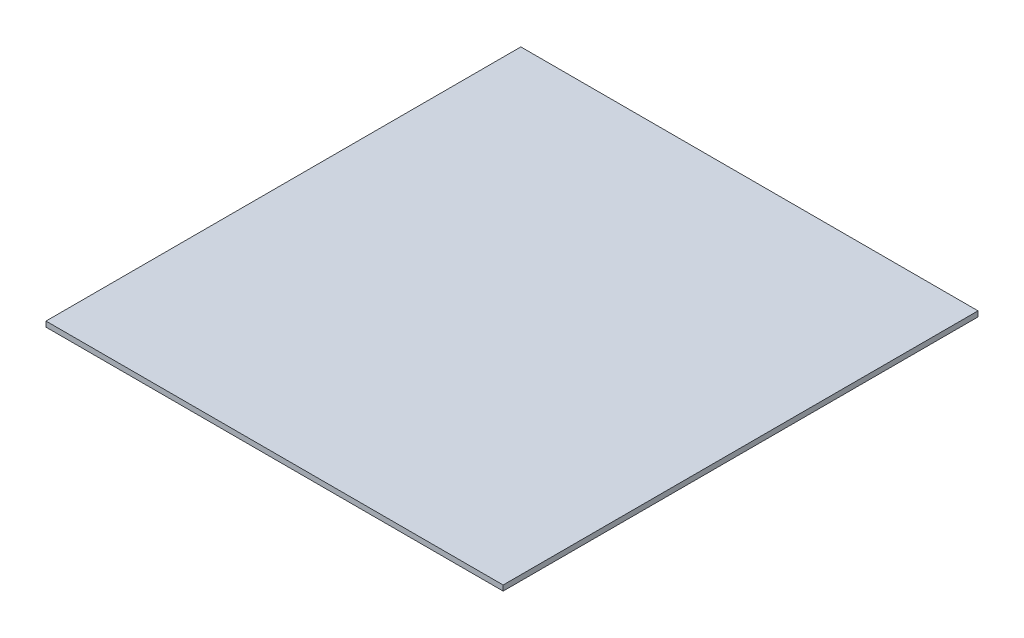
ISO-10303-21;
HEADER;
FILE_DESCRIPTION(('STEP AP214'),'2;1');
FILE_NAME('part.step','',(''),(''),'','','');
FILE_SCHEMA(('AUTOMOTIVE_DESIGN { 1 0 10303 214 1 1 1 1 }'));
ENDSEC;
DATA;
#1=APPLICATION_CONTEXT('core data for automotive mechanical design processes');
#2=APPLICATION_PROTOCOL_DEFINITION('international standard','automotive_design',2000,#1);
#3=PRODUCT_CONTEXT('',#1,'mechanical');
#4=PRODUCT('Part','Part','',(#3));
#5=PRODUCT_RELATED_PRODUCT_CATEGORY('part','',(#4));
#6=PRODUCT_DEFINITION_FORMATION('','',#4);
#7=PRODUCT_DEFINITION_CONTEXT('part definition',#1,'design');
#8=PRODUCT_DEFINITION('design','',#6,#7);
#9=PRODUCT_DEFINITION_SHAPE('','',#8);
#10=(LENGTH_UNIT() NAMED_UNIT(*) SI_UNIT(.MILLI.,.METRE.));
#11=(NAMED_UNIT(*) PLANE_ANGLE_UNIT() SI_UNIT($,.RADIAN.));
#12=(NAMED_UNIT(*) SI_UNIT($,.STERADIAN.) SOLID_ANGLE_UNIT());
#13=UNCERTAINTY_MEASURE_WITH_UNIT(LENGTH_MEASURE(1.E-05),#10,'distance_accuracy_value','');
#14=(GEOMETRIC_REPRESENTATION_CONTEXT(3) GLOBAL_UNCERTAINTY_ASSIGNED_CONTEXT((#13)) GLOBAL_UNIT_ASSIGNED_CONTEXT((#10,
#11,#12)) REPRESENTATION_CONTEXT('',''));
#15=CARTESIAN_POINT('',(0.,0.,0.));
#16=DIRECTION('',(0.,0.,1.));
#17=DIRECTION('',(1.,0.,0.));
#18=AXIS2_PLACEMENT_3D('',#15,#16,#17);
#19=CARTESIAN_POINT('',(0.,29.4,-130.));
#20=DIRECTION('',(-1.,0.,0.));
#21=DIRECTION('',(0.,0.,1.));
#22=AXIS2_PLACEMENT_3D('',#19,#20,#21);
#23=PLANE('',#22);
#24=DIRECTION('',(0.,0.,1.));
#25=VECTOR('',#24,1.);
#26=CARTESIAN_POINT('',(0.,30.,-130.));
#27=LINE('',#26,#25);
#28=CARTESIAN_POINT('',(0.,30.,-130.));
#29=VERTEX_POINT('',#28);
#30=CARTESIAN_POINT('',(0.,30.,0.));
#31=VERTEX_POINT('',#30);
#32=EDGE_CURVE('E131',#29,#31,#27,.T.);
#33=ORIENTED_EDGE('',*,*,#32,.F.);
#34=DIRECTION('',(0.,1.,0.));
#35=VECTOR('',#34,1.);
#36=CARTESIAN_POINT('',(0.,29.4,-130.));
#37=LINE('',#36,#35);
#38=CARTESIAN_POINT('',(0.,29.4,-130.));
#39=VERTEX_POINT('',#38);
#40=EDGE_CURVE('E11',#39,#29,#37,.T.);
#41=ORIENTED_EDGE('',*,*,#40,.F.);
#42=DIRECTION('',(0.,0.,1.));
#43=VECTOR('',#42,1.);
#44=CARTESIAN_POINT('',(0.,29.4,-130.));
#45=LINE('',#44,#43);
#46=CARTESIAN_POINT('',(0.,29.4,0.));
#47=VERTEX_POINT('',#46);
#48=EDGE_CURVE('E140',#39,#47,#45,.T.);
#49=ORIENTED_EDGE('',*,*,#48,.T.);
#50=DIRECTION('',(0.,1.,0.));
#51=VECTOR('',#50,1.);
#52=CARTESIAN_POINT('',(0.,29.4,0.));
#53=LINE('',#52,#51);
#54=EDGE_CURVE('E39',#47,#31,#53,.T.);
#55=ORIENTED_EDGE('',*,*,#54,.T.);
#56=EDGE_LOOP('',(#33,#41,#49,#55));
#57=FACE_BOUND('',#56,.T.);
#58=ADVANCED_FACE('F36',(#57),#23,.T.);
#59=CARTESIAN_POINT('',(0.,29.4,-130.));
#60=DIRECTION('',(0.,0.,-1.));
#61=DIRECTION('',(-1.,0.,0.));
#62=AXIS2_PLACEMENT_3D('',#59,#60,#61);
#63=PLANE('',#62);
#64=DIRECTION('',(-1.,0.,0.));
#65=VECTOR('',#64,1.);
#66=CARTESIAN_POINT('',(0.,30.,-130.));
#67=LINE('',#66,#65);
#68=CARTESIAN_POINT('',(125.,30.,-130.));
#69=VERTEX_POINT('',#68);
#70=EDGE_CURVE('E143',#69,#29,#67,.T.);
#71=ORIENTED_EDGE('',*,*,#70,.F.);
#72=DIRECTION('',(0.,1.,0.));
#73=VECTOR('',#72,1.);
#74=CARTESIAN_POINT('',(125.,29.4,-130.));
#75=LINE('',#74,#73);
#76=CARTESIAN_POINT('',(125.,29.4,-130.));
#77=VERTEX_POINT('',#76);
#78=EDGE_CURVE('E45',#77,#69,#75,.T.);
#79=ORIENTED_EDGE('',*,*,#78,.F.);
#80=DIRECTION('',(-1.,0.,0.));
#81=VECTOR('',#80,1.);
#82=CARTESIAN_POINT('',(0.,29.4,-130.));
#83=LINE('',#82,#81);
#84=EDGE_CURVE('E147',#77,#39,#83,.T.);
#85=ORIENTED_EDGE('',*,*,#84,.T.);
#86=ORIENTED_EDGE('',*,*,#40,.T.);
#87=EDGE_LOOP('',(#71,#79,#85,#86));
#88=FACE_BOUND('',#87,.T.);
#89=ADVANCED_FACE('F162',(#88),#63,.T.);
#90=CARTESIAN_POINT('',(125.,29.4,-130.));
#91=DIRECTION('',(1.,0.,0.));
#92=DIRECTION('',(0.,0.,-1.));
#93=AXIS2_PLACEMENT_3D('',#90,#91,#92);
#94=PLANE('',#93);
#95=DIRECTION('',(0.,0.,-1.));
#96=VECTOR('',#95,1.);
#97=CARTESIAN_POINT('',(125.,30.,-130.));
#98=LINE('',#97,#96);
#99=CARTESIAN_POINT('',(125.,30.,0.));
#100=VERTEX_POINT('',#99);
#101=EDGE_CURVE('E152',#100,#69,#98,.T.);
#102=ORIENTED_EDGE('',*,*,#101,.F.);
#103=DIRECTION('',(0.,1.,0.));
#104=VECTOR('',#103,1.);
#105=CARTESIAN_POINT('',(125.,29.4,0.));
#106=LINE('',#105,#104);
#107=CARTESIAN_POINT('',(125.,29.4,0.));
#108=VERTEX_POINT('',#107);
#109=EDGE_CURVE('E68',#108,#100,#106,.T.);
#110=ORIENTED_EDGE('',*,*,#109,.F.);
#111=DIRECTION('',(0.,0.,-1.));
#112=VECTOR('',#111,1.);
#113=CARTESIAN_POINT('',(125.,29.4,-130.));
#114=LINE('',#113,#112);
#115=EDGE_CURVE('E145',#108,#77,#114,.T.);
#116=ORIENTED_EDGE('',*,*,#115,.T.);
#117=ORIENTED_EDGE('',*,*,#78,.T.);
#118=EDGE_LOOP('',(#102,#110,#116,#117));
#119=FACE_BOUND('',#118,.T.);
#120=ADVANCED_FACE('F167',(#119),#94,.T.);
#121=CARTESIAN_POINT('',(0.,29.4,0.));
#122=DIRECTION('',(0.,0.,1.));
#123=DIRECTION('',(1.,0.,0.));
#124=AXIS2_PLACEMENT_3D('',#121,#122,#123);
#125=PLANE('',#124);
#126=DIRECTION('',(1.,0.,0.));
#127=VECTOR('',#126,1.);
#128=CARTESIAN_POINT('',(0.,30.,0.));
#129=LINE('',#128,#127);
#130=EDGE_CURVE('E134',#31,#100,#129,.T.);
#131=ORIENTED_EDGE('',*,*,#130,.F.);
#132=ORIENTED_EDGE('',*,*,#54,.F.);
#133=DIRECTION('',(1.,0.,0.));
#134=VECTOR('',#133,1.);
#135=CARTESIAN_POINT('',(0.,29.4,0.));
#136=LINE('',#135,#134);
#137=EDGE_CURVE('E142',#47,#108,#136,.T.);
#138=ORIENTED_EDGE('',*,*,#137,.T.);
#139=ORIENTED_EDGE('',*,*,#109,.T.);
#140=EDGE_LOOP('',(#131,#132,#138,#139));
#141=FACE_BOUND('',#140,.T.);
#142=ADVANCED_FACE('F157',(#141),#125,.T.);
#143=CARTESIAN_POINT('',(0.,29.4,0.));
#144=DIRECTION('',(0.,1.,0.));
#145=DIRECTION('',(0.,0.,1.));
#146=AXIS2_PLACEMENT_3D('',#143,#144,#145);
#147=PLANE('',#146);
#148=ORIENTED_EDGE('',*,*,#48,.F.);
#149=ORIENTED_EDGE('',*,*,#84,.F.);
#150=ORIENTED_EDGE('',*,*,#115,.F.);
#151=ORIENTED_EDGE('',*,*,#137,.F.);
#152=EDGE_LOOP('',(#148,#149,#150,#151));
#153=FACE_BOUND('',#152,.T.);
#154=ADVANCED_FACE('F166',(#153),#147,.F.);
#155=CARTESIAN_POINT('',(-2.,31.5,2.));
#156=DIRECTION('',(1.,0.,0.));
#157=DIRECTION('',(0.,0.,-1.));
#158=AXIS2_PLACEMENT_3D('',#155,#156,#157);
#159=PLANE('',#158);
#160=DIRECTION('',(0.,0.,1.));
#161=VECTOR('',#160,1.);
#162=CARTESIAN_POINT('',(-2.,30.,2.));
#163=LINE('',#162,#161);
#164=CARTESIAN_POINT('',(-2.,30.,-132.));
#165=VERTEX_POINT('',#164);
#166=CARTESIAN_POINT('',(-2.,30.,2.));
#167=VERTEX_POINT('',#166);
#168=EDGE_CURVE('E130',#165,#167,#163,.T.);
#169=ORIENTED_EDGE('',*,*,#168,.T.);
#170=DIRECTION('',(0.,-1.,0.));
#171=VECTOR('',#170,1.);
#172=CARTESIAN_POINT('',(-2.,31.5,2.));
#173=LINE('',#172,#171);
#174=CARTESIAN_POINT('',(-2.,31.5,2.));
#175=VERTEX_POINT('',#174);
#176=EDGE_CURVE('E110',#175,#167,#173,.T.);
#177=ORIENTED_EDGE('',*,*,#176,.F.);
#178=DIRECTION('',(0.,0.,1.));
#179=VECTOR('',#178,1.);
#180=CARTESIAN_POINT('',(-2.,31.5,2.));
#181=LINE('',#180,#179);
#182=CARTESIAN_POINT('',(-2.,31.5,-132.));
#183=VERTEX_POINT('',#182);
#184=EDGE_CURVE('E117',#183,#175,#181,.T.);
#185=ORIENTED_EDGE('',*,*,#184,.F.);
#186=DIRECTION('',(0.,-1.,0.));
#187=VECTOR('',#186,1.);
#188=CARTESIAN_POINT('',(-2.,31.5,-132.));
#189=LINE('',#188,#187);
#190=EDGE_CURVE('E258',#183,#165,#189,.T.);
#191=ORIENTED_EDGE('',*,*,#190,.T.);
#192=EDGE_LOOP('',(#169,#177,#185,#191));
#193=FACE_BOUND('',#192,.T.);
#194=ADVANCED_FACE('F128',(#193),#159,.F.);
#195=CARTESIAN_POINT('',(-2.,31.5,2.));
#196=DIRECTION('',(0.,0.,-1.));
#197=DIRECTION('',(-1.,0.,0.));
#198=AXIS2_PLACEMENT_3D('',#195,#196,#197);
#199=PLANE('',#198);
#200=DIRECTION('',(1.,0.,0.));
#201=VECTOR('',#200,1.);
#202=CARTESIAN_POINT('',(-2.,30.,2.));
#203=LINE('',#202,#201);
#204=CARTESIAN_POINT('',(127.,30.,2.));
#205=VERTEX_POINT('',#204);
#206=EDGE_CURVE('E264',#167,#205,#203,.T.);
#207=ORIENTED_EDGE('',*,*,#206,.T.);
#208=DIRECTION('',(0.,-1.,0.));
#209=VECTOR('',#208,1.);
#210=CARTESIAN_POINT('',(127.,31.5,2.));
#211=LINE('',#210,#209);
#212=CARTESIAN_POINT('',(127.,31.5,2.));
#213=VERTEX_POINT('',#212);
#214=EDGE_CURVE('E113',#213,#205,#211,.T.);
#215=ORIENTED_EDGE('',*,*,#214,.F.);
#216=DIRECTION('',(1.,0.,0.));
#217=VECTOR('',#216,1.);
#218=CARTESIAN_POINT('',(-2.,31.5,2.));
#219=LINE('',#218,#217);
#220=EDGE_CURVE('E106',#175,#213,#219,.T.);
#221=ORIENTED_EDGE('',*,*,#220,.F.);
#222=ORIENTED_EDGE('',*,*,#176,.T.);
#223=EDGE_LOOP('',(#207,#215,#221,#222));
#224=FACE_BOUND('',#223,.T.);
#225=ADVANCED_FACE('F108',(#224),#199,.F.);
#226=CARTESIAN_POINT('',(127.,31.5,2.));
#227=DIRECTION('',(-1.,0.,0.));
#228=DIRECTION('',(0.,0.,1.));
#229=AXIS2_PLACEMENT_3D('',#226,#227,#228);
#230=PLANE('',#229);
#231=DIRECTION('',(0.,0.,-1.));
#232=VECTOR('',#231,1.);
#233=CARTESIAN_POINT('',(127.,30.,2.));
#234=LINE('',#233,#232);
#235=CARTESIAN_POINT('',(127.,30.,-132.));
#236=VERTEX_POINT('',#235);
#237=EDGE_CURVE('E261',#205,#236,#234,.T.);
#238=ORIENTED_EDGE('',*,*,#237,.T.);
#239=DIRECTION('',(0.,-1.,0.));
#240=VECTOR('',#239,1.);
#241=CARTESIAN_POINT('',(127.,31.5,-132.));
#242=LINE('',#241,#240);
#243=CARTESIAN_POINT('',(127.,31.5,-132.));
#244=VERTEX_POINT('',#243);
#245=EDGE_CURVE('E136',#244,#236,#242,.T.);
#246=ORIENTED_EDGE('',*,*,#245,.F.);
#247=DIRECTION('',(0.,0.,-1.));
#248=VECTOR('',#247,1.);
#249=CARTESIAN_POINT('',(127.,31.5,2.));
#250=LINE('',#249,#248);
#251=EDGE_CURVE('E116',#213,#244,#250,.T.);
#252=ORIENTED_EDGE('',*,*,#251,.F.);
#253=ORIENTED_EDGE('',*,*,#214,.T.);
#254=EDGE_LOOP('',(#238,#246,#252,#253));
#255=FACE_BOUND('',#254,.T.);
#256=ADVANCED_FACE('F212',(#255),#230,.F.);
#257=CARTESIAN_POINT('',(-2.,31.5,-132.));
#258=DIRECTION('',(0.,0.,1.));
#259=DIRECTION('',(1.,0.,0.));
#260=AXIS2_PLACEMENT_3D('',#257,#258,#259);
#261=PLANE('',#260);
#262=DIRECTION('',(-1.,0.,0.));
#263=VECTOR('',#262,1.);
#264=CARTESIAN_POINT('',(-2.,30.,-132.));
#265=LINE('',#264,#263);
#266=EDGE_CURVE('E126',#236,#165,#265,.T.);
#267=ORIENTED_EDGE('',*,*,#266,.T.);
#268=ORIENTED_EDGE('',*,*,#190,.F.);
#269=DIRECTION('',(-1.,0.,0.));
#270=VECTOR('',#269,1.);
#271=CARTESIAN_POINT('',(-2.,31.5,-132.));
#272=LINE('',#271,#270);
#273=EDGE_CURVE('E122',#244,#183,#272,.T.);
#274=ORIENTED_EDGE('',*,*,#273,.F.);
#275=ORIENTED_EDGE('',*,*,#245,.T.);
#276=EDGE_LOOP('',(#267,#268,#274,#275));
#277=FACE_BOUND('',#276,.T.);
#278=ADVANCED_FACE('F221',(#277),#261,.F.);
#279=CARTESIAN_POINT('',(0.,31.5,0.));
#280=DIRECTION('',(0.,-1.,0.));
#281=DIRECTION('',(0.,0.,-1.));
#282=AXIS2_PLACEMENT_3D('',#279,#280,#281);
#283=PLANE('',#282);
#284=ORIENTED_EDGE('',*,*,#184,.T.);
#285=ORIENTED_EDGE('',*,*,#220,.T.);
#286=ORIENTED_EDGE('',*,*,#251,.T.);
#287=ORIENTED_EDGE('',*,*,#273,.T.);
#288=EDGE_LOOP('',(#284,#285,#286,#287));
#289=FACE_BOUND('',#288,.T.);
#290=ADVANCED_FACE('F120',(#289),#283,.F.);
#291=CARTESIAN_POINT('',(0.,30.,0.));
#292=DIRECTION('',(0.,-1.,0.));
#293=DIRECTION('',(0.,0.,-1.));
#294=AXIS2_PLACEMENT_3D('',#291,#292,#293);
#295=PLANE('',#294);
#296=ORIENTED_EDGE('',*,*,#70,.T.);
#297=ORIENTED_EDGE('',*,*,#32,.T.);
#298=ORIENTED_EDGE('',*,*,#130,.T.);
#299=ORIENTED_EDGE('',*,*,#101,.T.);
#300=EDGE_LOOP('',(#296,#297,#298,#299));
#301=FACE_BOUND('',#300,.T.);
#302=ORIENTED_EDGE('',*,*,#168,.F.);
#303=ORIENTED_EDGE('',*,*,#266,.F.);
#304=ORIENTED_EDGE('',*,*,#237,.F.);
#305=ORIENTED_EDGE('',*,*,#206,.F.);
#306=EDGE_LOOP('',(#302,#303,#304,#305));
#307=FACE_BOUND('',#306,.T.);
#308=ADVANCED_FACE('F159',(#301,#307),#295,.T.);
#309=CLOSED_SHELL('',(#58,#89,#120,#142,#154,#194,#225,#256,#278,#290,#308));
#310=MANIFOLD_SOLID_BREP('B2',#309);
#311=ADVANCED_BREP_SHAPE_REPRESENTATION('',(#18,#310),#14);
#312=SHAPE_DEFINITION_REPRESENTATION(#9,#311);
ENDSEC;
END-ISO-10303-21;
